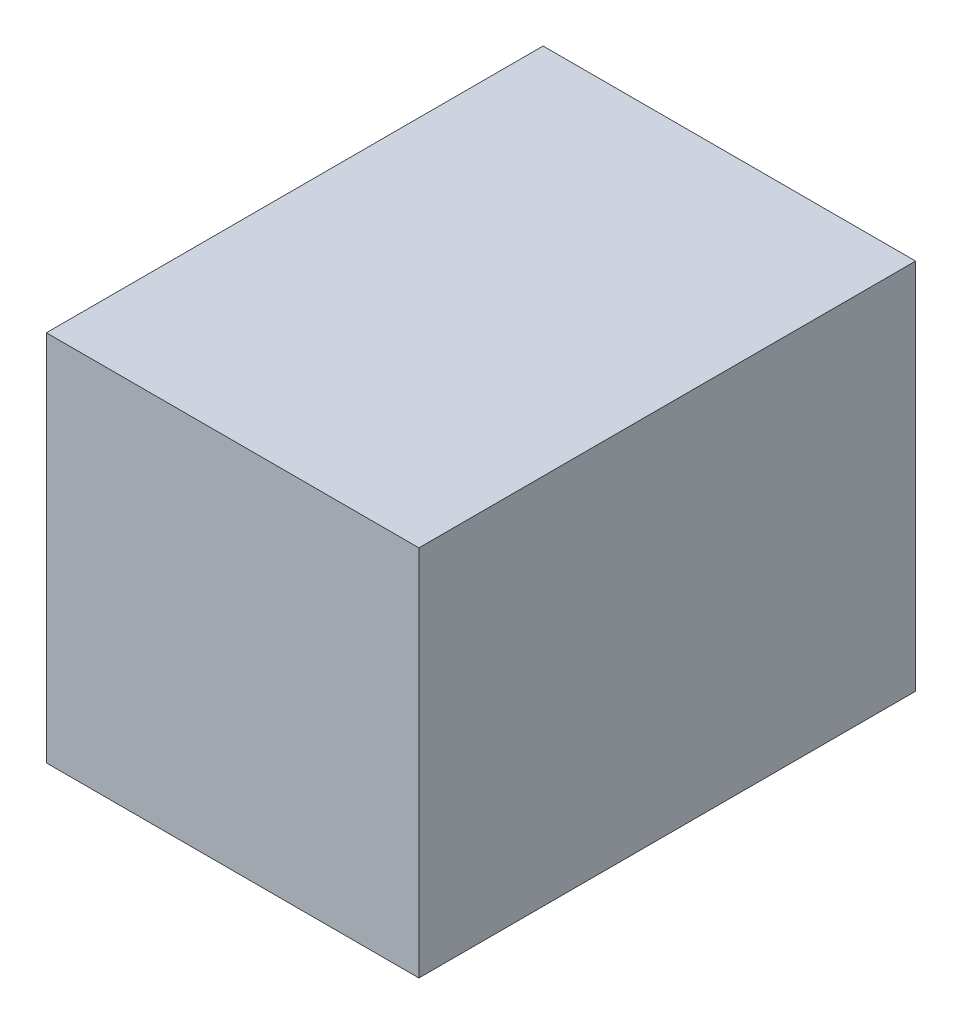
ISO-10303-21;
HEADER;
FILE_DESCRIPTION(('STEP AP214'),'2;1');
FILE_NAME('part.step','',(''),(''),'','','');
FILE_SCHEMA(('AUTOMOTIVE_DESIGN { 1 0 10303 214 1 1 1 1 }'));
ENDSEC;
DATA;
#1=APPLICATION_CONTEXT('core data for automotive mechanical design processes');
#2=APPLICATION_PROTOCOL_DEFINITION('international standard','automotive_design',2000,#1);
#3=PRODUCT_CONTEXT('',#1,'mechanical');
#4=PRODUCT('Part','Part','',(#3));
#5=PRODUCT_RELATED_PRODUCT_CATEGORY('part','',(#4));
#6=PRODUCT_DEFINITION_FORMATION('','',#4);
#7=PRODUCT_DEFINITION_CONTEXT('part definition',#1,'design');
#8=PRODUCT_DEFINITION('design','',#6,#7);
#9=PRODUCT_DEFINITION_SHAPE('','',#8);
#10=(LENGTH_UNIT() NAMED_UNIT(*) SI_UNIT(.MILLI.,.METRE.));
#11=(NAMED_UNIT(*) PLANE_ANGLE_UNIT() SI_UNIT($,.RADIAN.));
#12=(NAMED_UNIT(*) SI_UNIT($,.STERADIAN.) SOLID_ANGLE_UNIT());
#13=UNCERTAINTY_MEASURE_WITH_UNIT(LENGTH_MEASURE(1.E-05),#10,'distance_accuracy_value','');
#14=(GEOMETRIC_REPRESENTATION_CONTEXT(3) GLOBAL_UNCERTAINTY_ASSIGNED_CONTEXT((#13)) GLOBAL_UNIT_ASSIGNED_CONTEXT((#10,
#11,#12)) REPRESENTATION_CONTEXT('',''));
#15=CARTESIAN_POINT('',(0.,0.,0.));
#16=DIRECTION('',(0.,0.,1.));
#17=DIRECTION('',(1.,0.,0.));
#18=AXIS2_PLACEMENT_3D('',#15,#16,#17);
#19=CARTESIAN_POINT('',(0.,0.,101.6));
#20=DIRECTION('',(1.,0.,0.));
#21=DIRECTION('',(0.,0.,-1.));
#22=AXIS2_PLACEMENT_3D('',#19,#20,#21);
#23=PLANE('',#22);
#24=DIRECTION('',(0.,-1.,0.));
#25=VECTOR('',#24,1.);
#26=CARTESIAN_POINT('',(0.,0.,0.));
#27=LINE('',#26,#25);
#28=CARTESIAN_POINT('',(0.,76.2,0.));
#29=VERTEX_POINT('',#28);
#30=CARTESIAN_POINT('',(0.,0.,0.));
#31=VERTEX_POINT('',#30);
#32=EDGE_CURVE('E107',#29,#31,#27,.T.);
#33=ORIENTED_EDGE('',*,*,#32,.T.);
#34=DIRECTION('',(0.,0.,-1.));
#35=VECTOR('',#34,1.);
#36=CARTESIAN_POINT('',(0.,0.,101.6));
#37=LINE('',#36,#35);
#38=CARTESIAN_POINT('',(0.,0.,101.6));
#39=VERTEX_POINT('',#38);
#40=EDGE_CURVE('E11',#39,#31,#37,.T.);
#41=ORIENTED_EDGE('',*,*,#40,.F.);
#42=DIRECTION('',(0.,-1.,0.));
#43=VECTOR('',#42,1.);
#44=CARTESIAN_POINT('',(0.,0.,101.6));
#45=LINE('',#44,#43);
#46=CARTESIAN_POINT('',(0.,76.2,101.6));
#47=VERTEX_POINT('',#46);
#48=EDGE_CURVE('E91',#47,#39,#45,.T.);
#49=ORIENTED_EDGE('',*,*,#48,.F.);
#50=DIRECTION('',(0.,0.,-1.));
#51=VECTOR('',#50,1.);
#52=CARTESIAN_POINT('',(0.,76.2,101.6));
#53=LINE('',#52,#51);
#54=EDGE_CURVE('E103',#47,#29,#53,.T.);
#55=ORIENTED_EDGE('',*,*,#54,.T.);
#56=EDGE_LOOP('',(#33,#41,#49,#55));
#57=FACE_BOUND('',#56,.T.);
#58=ADVANCED_FACE('F39',(#57),#23,.F.);
#59=CARTESIAN_POINT('',(0.,0.,101.6));
#60=DIRECTION('',(0.,1.,0.));
#61=DIRECTION('',(0.,0.,1.));
#62=AXIS2_PLACEMENT_3D('',#59,#60,#61);
#63=PLANE('',#62);
#64=DIRECTION('',(1.,0.,0.));
#65=VECTOR('',#64,1.);
#66=CARTESIAN_POINT('',(0.,0.,0.));
#67=LINE('',#66,#65);
#68=CARTESIAN_POINT('',(76.2,0.,0.));
#69=VERTEX_POINT('',#68);
#70=EDGE_CURVE('E96',#31,#69,#67,.T.);
#71=ORIENTED_EDGE('',*,*,#70,.T.);
#72=DIRECTION('',(0.,0.,-1.));
#73=VECTOR('',#72,1.);
#74=CARTESIAN_POINT('',(76.2,0.,101.6));
#75=LINE('',#74,#73);
#76=CARTESIAN_POINT('',(76.2,0.,101.6));
#77=VERTEX_POINT('',#76);
#78=EDGE_CURVE('E48',#77,#69,#75,.T.);
#79=ORIENTED_EDGE('',*,*,#78,.F.);
#80=DIRECTION('',(1.,0.,0.));
#81=VECTOR('',#80,1.);
#82=CARTESIAN_POINT('',(0.,0.,101.6));
#83=LINE('',#82,#81);
#84=EDGE_CURVE('E86',#39,#77,#83,.T.);
#85=ORIENTED_EDGE('',*,*,#84,.F.);
#86=ORIENTED_EDGE('',*,*,#40,.T.);
#87=EDGE_LOOP('',(#71,#79,#85,#86));
#88=FACE_BOUND('',#87,.T.);
#89=ADVANCED_FACE('F95',(#88),#63,.F.);
#90=CARTESIAN_POINT('',(76.2,0.,101.6));
#91=DIRECTION('',(-1.,0.,0.));
#92=DIRECTION('',(0.,0.,1.));
#93=AXIS2_PLACEMENT_3D('',#90,#91,#92);
#94=PLANE('',#93);
#95=DIRECTION('',(0.,1.,0.));
#96=VECTOR('',#95,1.);
#97=CARTESIAN_POINT('',(76.2,0.,0.));
#98=LINE('',#97,#96);
#99=CARTESIAN_POINT('',(76.2,76.2,0.));
#100=VERTEX_POINT('',#99);
#101=EDGE_CURVE('E73',#69,#100,#98,.T.);
#102=ORIENTED_EDGE('',*,*,#101,.T.);
#103=DIRECTION('',(0.,0.,-1.));
#104=VECTOR('',#103,1.);
#105=CARTESIAN_POINT('',(76.2,76.2,101.6));
#106=LINE('',#105,#104);
#107=CARTESIAN_POINT('',(76.2,76.2,101.6));
#108=VERTEX_POINT('',#107);
#109=EDGE_CURVE('E98',#108,#100,#106,.T.);
#110=ORIENTED_EDGE('',*,*,#109,.F.);
#111=DIRECTION('',(0.,1.,0.));
#112=VECTOR('',#111,1.);
#113=CARTESIAN_POINT('',(76.2,0.,101.6));
#114=LINE('',#113,#112);
#115=EDGE_CURVE('E89',#77,#108,#114,.T.);
#116=ORIENTED_EDGE('',*,*,#115,.F.);
#117=ORIENTED_EDGE('',*,*,#78,.T.);
#118=EDGE_LOOP('',(#102,#110,#116,#117));
#119=FACE_BOUND('',#118,.T.);
#120=ADVANCED_FACE('F99',(#119),#94,.F.);
#121=CARTESIAN_POINT('',(0.,76.2,101.6));
#122=DIRECTION('',(0.,-1.,0.));
#123=DIRECTION('',(1.,0.,0.));
#124=AXIS2_PLACEMENT_3D('',#121,#122,#123);
#125=PLANE('',#124);
#126=DIRECTION('',(-1.,0.,0.));
#127=VECTOR('',#126,1.);
#128=CARTESIAN_POINT('',(0.,76.2,0.));
#129=LINE('',#128,#127);
#130=EDGE_CURVE('E79',#100,#29,#129,.T.);
#131=ORIENTED_EDGE('',*,*,#130,.T.);
#132=ORIENTED_EDGE('',*,*,#54,.F.);
#133=DIRECTION('',(-1.,0.,0.));
#134=VECTOR('',#133,1.);
#135=CARTESIAN_POINT('',(0.,76.2,101.6));
#136=LINE('',#135,#134);
#137=EDGE_CURVE('E56',#108,#47,#136,.T.);
#138=ORIENTED_EDGE('',*,*,#137,.F.);
#139=ORIENTED_EDGE('',*,*,#109,.T.);
#140=EDGE_LOOP('',(#131,#132,#138,#139));
#141=FACE_BOUND('',#140,.T.);
#142=ADVANCED_FACE('F120',(#141),#125,.F.);
#143=CARTESIAN_POINT('',(0.,0.,101.6));
#144=DIRECTION('',(0.,0.,-1.));
#145=DIRECTION('',(-1.,0.,0.));
#146=AXIS2_PLACEMENT_3D('',#143,#144,#145);
#147=PLANE('',#146);
#148=ORIENTED_EDGE('',*,*,#48,.T.);
#149=ORIENTED_EDGE('',*,*,#84,.T.);
#150=ORIENTED_EDGE('',*,*,#115,.T.);
#151=ORIENTED_EDGE('',*,*,#137,.T.);
#152=EDGE_LOOP('',(#148,#149,#150,#151));
#153=FACE_BOUND('',#152,.T.);
#154=ADVANCED_FACE('F87',(#153),#147,.F.);
#155=CARTESIAN_POINT('',(0.,0.,0.));
#156=DIRECTION('',(0.,0.,-1.));
#157=DIRECTION('',(-1.,0.,0.));
#158=AXIS2_PLACEMENT_3D('',#155,#156,#157);
#159=PLANE('',#158);
#160=ORIENTED_EDGE('',*,*,#32,.F.);
#161=ORIENTED_EDGE('',*,*,#130,.F.);
#162=ORIENTED_EDGE('',*,*,#101,.F.);
#163=ORIENTED_EDGE('',*,*,#70,.F.);
#164=EDGE_LOOP('',(#160,#161,#162,#163));
#165=FACE_BOUND('',#164,.T.);
#166=ADVANCED_FACE('F123',(#165),#159,.T.);
#167=CLOSED_SHELL('',(#58,#89,#120,#142,#154,#166));
#168=MANIFOLD_SOLID_BREP('B2',#167);
#169=ADVANCED_BREP_SHAPE_REPRESENTATION('',(#18,#168),#14);
#170=SHAPE_DEFINITION_REPRESENTATION(#9,#169);
ENDSEC;
END-ISO-10303-21;
